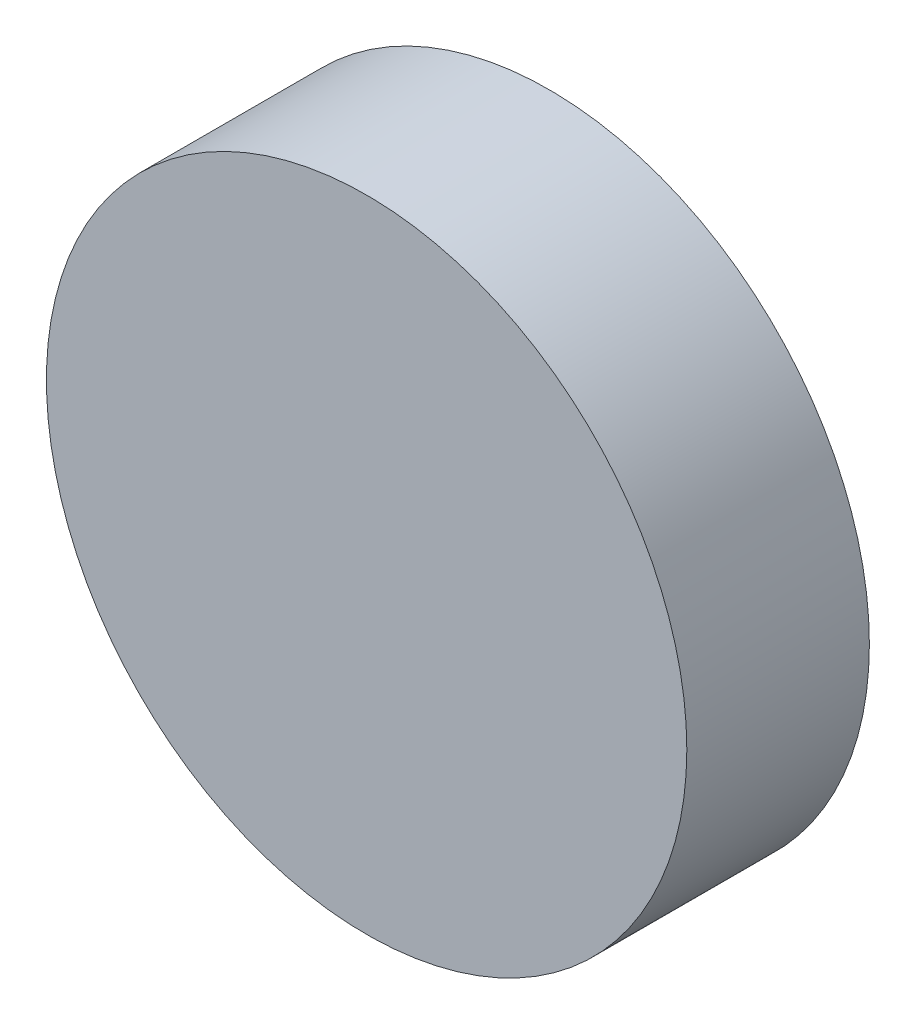
ISO-10303-21;
HEADER;
FILE_DESCRIPTION(('STEP AP214'),'2;1');
FILE_NAME('part.step','',(''),(''),'','','');
FILE_SCHEMA(('AUTOMOTIVE_DESIGN { 1 0 10303 214 1 1 1 1 }'));
ENDSEC;
DATA;
#1=APPLICATION_CONTEXT('core data for automotive mechanical design processes');
#2=APPLICATION_PROTOCOL_DEFINITION('international standard','automotive_design',2000,#1);
#3=PRODUCT_CONTEXT('',#1,'mechanical');
#4=PRODUCT('Part','Part','',(#3));
#5=PRODUCT_RELATED_PRODUCT_CATEGORY('part','',(#4));
#6=PRODUCT_DEFINITION_FORMATION('','',#4);
#7=PRODUCT_DEFINITION_CONTEXT('part definition',#1,'design');
#8=PRODUCT_DEFINITION('design','',#6,#7);
#9=PRODUCT_DEFINITION_SHAPE('','',#8);
#10=(LENGTH_UNIT() NAMED_UNIT(*) SI_UNIT(.MILLI.,.METRE.));
#11=(NAMED_UNIT(*) PLANE_ANGLE_UNIT() SI_UNIT($,.RADIAN.));
#12=(NAMED_UNIT(*) SI_UNIT($,.STERADIAN.) SOLID_ANGLE_UNIT());
#13=UNCERTAINTY_MEASURE_WITH_UNIT(LENGTH_MEASURE(1.E-05),#10,'distance_accuracy_value','');
#14=(GEOMETRIC_REPRESENTATION_CONTEXT(3) GLOBAL_UNCERTAINTY_ASSIGNED_CONTEXT((#13)) GLOBAL_UNIT_ASSIGNED_CONTEXT((#10,
#11,#12)) REPRESENTATION_CONTEXT('',''));
#15=CARTESIAN_POINT('',(0.,0.,0.));
#16=DIRECTION('',(0.,0.,1.));
#17=DIRECTION('',(1.,0.,0.));
#18=AXIS2_PLACEMENT_3D('',#15,#16,#17);
#19=CARTESIAN_POINT('',(0.,0.,50.));
#20=DIRECTION('',(0.,0.,-1.));
#21=DIRECTION('',(-1.,0.,0.));
#22=AXIS2_PLACEMENT_3D('',#19,#20,#21);
#23=CYLINDRICAL_SURFACE('',#22,87.6977112926905);
#24=CARTESIAN_POINT('',(0.,0.,50.));
#25=DIRECTION('',(0.,0.,1.));
#26=DIRECTION('',(1.,0.,0.));
#27=AXIS2_PLACEMENT_3D('',#24,#25,#26);
#28=CIRCLE('',#27,87.6977112926905);
#29=CARTESIAN_POINT('',(87.6977112926905,0.,50.));
#30=VERTEX_POINT('',#29);
#31=EDGE_CURVE('E10',#30,#30,#28,.T.);
#32=ORIENTED_EDGE('',*,*,#31,.F.);
#33=EDGE_LOOP('',(#32));
#34=FACE_BOUND('',#33,.T.);
#35=CARTESIAN_POINT('',(0.,0.,0.));
#36=DIRECTION('',(0.,0.,1.));
#37=DIRECTION('',(1.,0.,0.));
#38=AXIS2_PLACEMENT_3D('',#35,#36,#37);
#39=CIRCLE('',#38,87.6977112926905);
#40=CARTESIAN_POINT('',(87.6977112926905,0.,0.));
#41=VERTEX_POINT('',#40);
#42=EDGE_CURVE('E36',#41,#41,#39,.T.);
#43=ORIENTED_EDGE('',*,*,#42,.T.);
#44=EDGE_LOOP('',(#43));
#45=FACE_BOUND('',#44,.T.);
#46=ADVANCED_FACE('F33',(#34,#45),#23,.T.);
#47=CARTESIAN_POINT('',(0.,0.,50.));
#48=DIRECTION('',(0.,0.,1.));
#49=DIRECTION('',(1.,0.,0.));
#50=AXIS2_PLACEMENT_3D('',#47,#48,#49);
#51=PLANE('',#50);
#52=ORIENTED_EDGE('',*,*,#31,.T.);
#53=EDGE_LOOP('',(#52));
#54=FACE_BOUND('',#53,.T.);
#55=ADVANCED_FACE('F48',(#54),#51,.T.);
#56=CARTESIAN_POINT('',(0.,0.,0.));
#57=DIRECTION('',(0.,0.,1.));
#58=DIRECTION('',(1.,0.,0.));
#59=AXIS2_PLACEMENT_3D('',#56,#57,#58);
#60=PLANE('',#59);
#61=ORIENTED_EDGE('',*,*,#42,.F.);
#62=EDGE_LOOP('',(#61));
#63=FACE_BOUND('',#62,.T.);
#64=ADVANCED_FACE('F46',(#63),#60,.F.);
#65=CLOSED_SHELL('',(#46,#55,#64));
#66=MANIFOLD_SOLID_BREP('B2',#65);
#67=ADVANCED_BREP_SHAPE_REPRESENTATION('',(#18,#66),#14);
#68=SHAPE_DEFINITION_REPRESENTATION(#9,#67);
ENDSEC;
END-ISO-10303-21;
